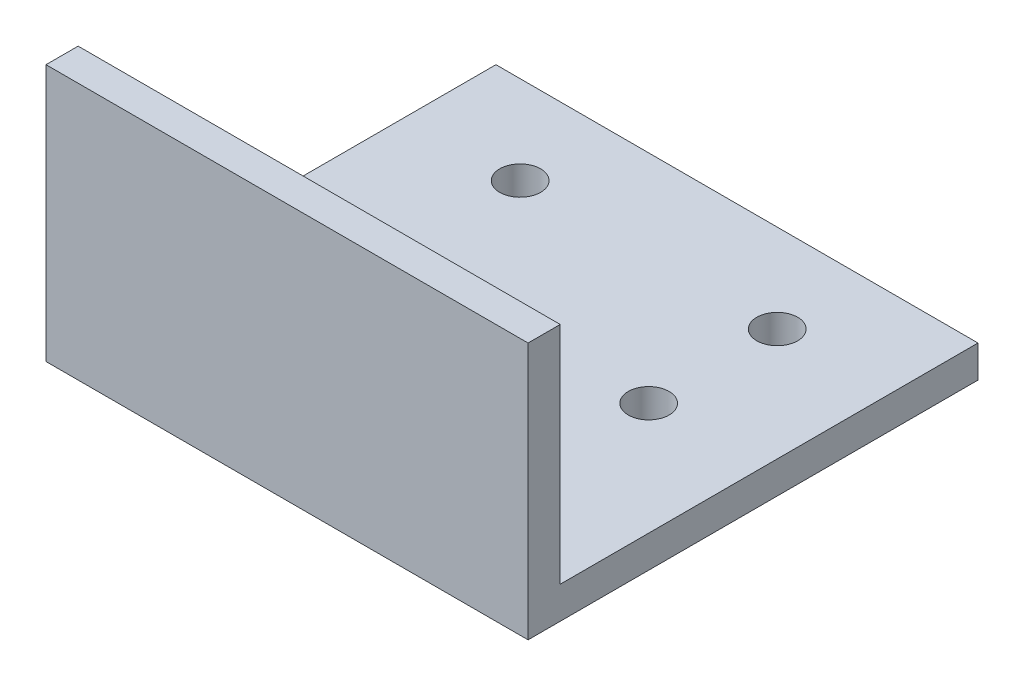
ISO-10303-21;
HEADER;
FILE_DESCRIPTION(('STEP AP214'),'2;1');
FILE_NAME('part.step','',(''),(''),'','','');
FILE_SCHEMA(('AUTOMOTIVE_DESIGN { 1 0 10303 214 1 1 1 1 }'));
ENDSEC;
DATA;
#1=APPLICATION_CONTEXT('core data for automotive mechanical design processes');
#2=APPLICATION_PROTOCOL_DEFINITION('international standard','automotive_design',2000,#1);
#3=PRODUCT_CONTEXT('',#1,'mechanical');
#4=PRODUCT('Part','Part','',(#3));
#5=PRODUCT_RELATED_PRODUCT_CATEGORY('part','',(#4));
#6=PRODUCT_DEFINITION_FORMATION('','',#4);
#7=PRODUCT_DEFINITION_CONTEXT('part definition',#1,'design');
#8=PRODUCT_DEFINITION('design','',#6,#7);
#9=PRODUCT_DEFINITION_SHAPE('','',#8);
#10=(LENGTH_UNIT() NAMED_UNIT(*) SI_UNIT(.MILLI.,.METRE.));
#11=(NAMED_UNIT(*) PLANE_ANGLE_UNIT() SI_UNIT($,.RADIAN.));
#12=(NAMED_UNIT(*) SI_UNIT($,.STERADIAN.) SOLID_ANGLE_UNIT());
#13=UNCERTAINTY_MEASURE_WITH_UNIT(LENGTH_MEASURE(1.E-05),#10,'distance_accuracy_value','');
#14=(GEOMETRIC_REPRESENTATION_CONTEXT(3) GLOBAL_UNCERTAINTY_ASSIGNED_CONTEXT((#13)) GLOBAL_UNIT_ASSIGNED_CONTEXT((#10,
#11,#12)) REPRESENTATION_CONTEXT('',''));
#15=CARTESIAN_POINT('',(0.,0.,0.));
#16=DIRECTION('',(0.,0.,1.));
#17=DIRECTION('',(1.,0.,0.));
#18=AXIS2_PLACEMENT_3D('',#15,#16,#17);
#19=CARTESIAN_POINT('',(47.625,0.,0.));
#20=DIRECTION('',(0.,0.,-1.));
#21=DIRECTION('',(-1.,0.,0.));
#22=AXIS2_PLACEMENT_3D('',#19,#20,#21);
#23=PLANE('',#22);
#24=DIRECTION('',(0.,-1.,0.));
#25=VECTOR('',#24,1.);
#26=CARTESIAN_POINT('',(0.,0.,0.));
#27=LINE('',#26,#25);
#28=CARTESIAN_POINT('',(0.,25.4,0.));
#29=VERTEX_POINT('',#28);
#30=CARTESIAN_POINT('',(0.,0.,0.));
#31=VERTEX_POINT('',#30);
#32=EDGE_CURVE('E122',#29,#31,#27,.T.);
#33=ORIENTED_EDGE('',*,*,#32,.T.);
#34=DIRECTION('',(-1.,0.,0.));
#35=VECTOR('',#34,1.);
#36=CARTESIAN_POINT('',(47.625,0.,0.));
#37=LINE('',#36,#35);
#38=CARTESIAN_POINT('',(47.625,0.,0.));
#39=VERTEX_POINT('',#38);
#40=EDGE_CURVE('E11',#39,#31,#37,.T.);
#41=ORIENTED_EDGE('',*,*,#40,.F.);
#42=DIRECTION('',(0.,-1.,0.));
#43=VECTOR('',#42,1.);
#44=CARTESIAN_POINT('',(47.625,0.,0.));
#45=LINE('',#44,#43);
#46=CARTESIAN_POINT('',(47.625,25.4,0.));
#47=VERTEX_POINT('',#46);
#48=EDGE_CURVE('E135',#47,#39,#45,.T.);
#49=ORIENTED_EDGE('',*,*,#48,.F.);
#50=DIRECTION('',(-1.,0.,0.));
#51=VECTOR('',#50,1.);
#52=CARTESIAN_POINT('',(47.625,25.4,0.));
#53=LINE('',#52,#51);
#54=EDGE_CURVE('E118',#47,#29,#53,.T.);
#55=ORIENTED_EDGE('',*,*,#54,.T.);
#56=EDGE_LOOP('',(#33,#41,#49,#55));
#57=FACE_BOUND('',#56,.T.);
#58=ADVANCED_FACE('F37',(#57),#23,.F.);
#59=CARTESIAN_POINT('',(47.625,0.,0.));
#60=DIRECTION('',(0.,1.,0.));
#61=DIRECTION('',(0.,0.,1.));
#62=AXIS2_PLACEMENT_3D('',#59,#60,#61);
#63=PLANE('',#62);
#64=CARTESIAN_POINT('',(11.1125,0.,-35.729000000002));
#65=DIRECTION('',(0.,1.,0.));
#66=DIRECTION('',(0.,0.,1.));
#67=AXIS2_PLACEMENT_3D('',#64,#65,#66);
#68=CIRCLE('',#67,2.01929999999999);
#69=CARTESIAN_POINT('',(11.1125,0.,-33.709700000002));
#70=VERTEX_POINT('',#69);
#71=EDGE_CURVE('E193',#70,#70,#68,.F.);
#72=ORIENTED_EDGE('',*,*,#71,.F.);
#73=EDGE_LOOP('',(#72));
#74=FACE_BOUND('',#73,.T.);
#75=CARTESIAN_POINT('',(36.5125,0.,-23.029000000002));
#76=DIRECTION('',(0.,1.,0.));
#77=DIRECTION('',(0.,0.,1.));
#78=AXIS2_PLACEMENT_3D('',#75,#76,#77);
#79=CIRCLE('',#78,2.01929999999999);
#80=CARTESIAN_POINT('',(36.5125,0.,-21.009700000002));
#81=VERTEX_POINT('',#80);
#82=EDGE_CURVE('E201',#81,#81,#79,.F.);
#83=ORIENTED_EDGE('',*,*,#82,.F.);
#84=EDGE_LOOP('',(#83));
#85=FACE_BOUND('',#84,.T.);
#86=CARTESIAN_POINT('',(36.5125,0.,-35.729000000002));
#87=DIRECTION('',(0.,1.,0.));
#88=DIRECTION('',(0.,0.,1.));
#89=AXIS2_PLACEMENT_3D('',#86,#87,#88);
#90=CIRCLE('',#89,2.01929999999999);
#91=CARTESIAN_POINT('',(36.5125,0.,-33.709700000002));
#92=VERTEX_POINT('',#91);
#93=EDGE_CURVE('E207',#92,#92,#90,.F.);
#94=ORIENTED_EDGE('',*,*,#93,.F.);
#95=EDGE_LOOP('',(#94));
#96=FACE_BOUND('',#95,.T.);
#97=CARTESIAN_POINT('',(11.1125,0.,-23.029000000002));
#98=DIRECTION('',(0.,1.,0.));
#99=DIRECTION('',(0.,0.,1.));
#100=AXIS2_PLACEMENT_3D('',#97,#98,#99);
#101=CIRCLE('',#100,2.01929999999999);
#102=CARTESIAN_POINT('',(11.1125,0.,-21.009700000002));
#103=VERTEX_POINT('',#102);
#104=EDGE_CURVE('E126',#103,#103,#101,.F.);
#105=ORIENTED_EDGE('',*,*,#104,.F.);
#106=EDGE_LOOP('',(#105));
#107=FACE_BOUND('',#106,.T.);
#108=DIRECTION('',(0.,0.,-1.));
#109=VECTOR('',#108,1.);
#110=CARTESIAN_POINT('',(0.,0.,0.));
#111=LINE('',#110,#109);
#112=CARTESIAN_POINT('',(0.,0.,-44.45));
#113=VERTEX_POINT('',#112);
#114=EDGE_CURVE('E125',#31,#113,#111,.T.);
#115=ORIENTED_EDGE('',*,*,#114,.T.);
#116=DIRECTION('',(-1.,0.,0.));
#117=VECTOR('',#116,1.);
#118=CARTESIAN_POINT('',(47.625,0.,-44.45));
#119=LINE('',#118,#117);
#120=CARTESIAN_POINT('',(47.625,0.,-44.45));
#121=VERTEX_POINT('',#120);
#122=EDGE_CURVE('E45',#121,#113,#119,.T.);
#123=ORIENTED_EDGE('',*,*,#122,.F.);
#124=DIRECTION('',(0.,0.,-1.));
#125=VECTOR('',#124,1.);
#126=CARTESIAN_POINT('',(47.625,0.,0.));
#127=LINE('',#126,#125);
#128=EDGE_CURVE('E90',#39,#121,#127,.T.);
#129=ORIENTED_EDGE('',*,*,#128,.F.);
#130=ORIENTED_EDGE('',*,*,#40,.T.);
#131=EDGE_LOOP('',(#115,#123,#129,#130));
#132=FACE_BOUND('',#131,.T.);
#133=ADVANCED_FACE('F161',(#74,#85,#96,#107,#132),#63,.F.);
#134=CARTESIAN_POINT('',(47.625,0.,-44.45));
#135=DIRECTION('',(0.,0.,1.));
#136=DIRECTION('',(1.,0.,0.));
#137=AXIS2_PLACEMENT_3D('',#134,#135,#136);
#138=PLANE('',#137);
#139=DIRECTION('',(0.,1.,0.));
#140=VECTOR('',#139,1.);
#141=CARTESIAN_POINT('',(0.,0.,-44.45));
#142=LINE('',#141,#140);
#143=CARTESIAN_POINT('',(0.,3.175,-44.45));
#144=VERTEX_POINT('',#143);
#145=EDGE_CURVE('E129',#113,#144,#142,.T.);
#146=ORIENTED_EDGE('',*,*,#145,.T.);
#147=DIRECTION('',(-1.,0.,0.));
#148=VECTOR('',#147,1.);
#149=CARTESIAN_POINT('',(47.625,3.175,-44.45));
#150=LINE('',#149,#148);
#151=CARTESIAN_POINT('',(47.625,3.175,-44.45));
#152=VERTEX_POINT('',#151);
#153=EDGE_CURVE('E113',#152,#144,#150,.T.);
#154=ORIENTED_EDGE('',*,*,#153,.F.);
#155=DIRECTION('',(0.,1.,0.));
#156=VECTOR('',#155,1.);
#157=CARTESIAN_POINT('',(47.625,0.,-44.45));
#158=LINE('',#157,#156);
#159=EDGE_CURVE('E103',#121,#152,#158,.T.);
#160=ORIENTED_EDGE('',*,*,#159,.F.);
#161=ORIENTED_EDGE('',*,*,#122,.T.);
#162=EDGE_LOOP('',(#146,#154,#160,#161));
#163=FACE_BOUND('',#162,.T.);
#164=ADVANCED_FACE('F143',(#163),#138,.F.);
#165=CARTESIAN_POINT('',(47.625,3.175,-3.175));
#166=DIRECTION('',(0.,-1.,0.));
#167=DIRECTION('',(0.,0.,-1.));
#168=AXIS2_PLACEMENT_3D('',#165,#166,#167);
#169=PLANE('',#168);
#170=CARTESIAN_POINT('',(11.1125,3.175,-35.729000000002));
#171=DIRECTION('',(0.,1.,0.));
#172=DIRECTION('',(0.,0.,1.));
#173=AXIS2_PLACEMENT_3D('',#170,#171,#172);
#174=CIRCLE('',#173,2.01929999999999);
#175=CARTESIAN_POINT('',(11.1125,3.175,-33.709700000002));
#176=VERTEX_POINT('',#175);
#177=EDGE_CURVE('E179',#176,#176,#174,.T.);
#178=ORIENTED_EDGE('',*,*,#177,.F.);
#179=EDGE_LOOP('',(#178));
#180=FACE_BOUND('',#179,.T.);
#181=CARTESIAN_POINT('',(36.5125,3.175,-23.029000000002));
#182=DIRECTION('',(0.,1.,0.));
#183=DIRECTION('',(0.,0.,1.));
#184=AXIS2_PLACEMENT_3D('',#181,#182,#183);
#185=CIRCLE('',#184,2.01929999999999);
#186=CARTESIAN_POINT('',(36.5125,3.175,-21.009700000002));
#187=VERTEX_POINT('',#186);
#188=EDGE_CURVE('E183',#187,#187,#185,.T.);
#189=ORIENTED_EDGE('',*,*,#188,.F.);
#190=EDGE_LOOP('',(#189));
#191=FACE_BOUND('',#190,.T.);
#192=CARTESIAN_POINT('',(36.5125,3.175,-35.729000000002));
#193=DIRECTION('',(0.,1.,0.));
#194=DIRECTION('',(0.,0.,1.));
#195=AXIS2_PLACEMENT_3D('',#192,#193,#194);
#196=CIRCLE('',#195,2.01929999999999);
#197=CARTESIAN_POINT('',(36.5125,3.175,-33.709700000002));
#198=VERTEX_POINT('',#197);
#199=EDGE_CURVE('E187',#198,#198,#196,.T.);
#200=ORIENTED_EDGE('',*,*,#199,.F.);
#201=EDGE_LOOP('',(#200));
#202=FACE_BOUND('',#201,.T.);
#203=CARTESIAN_POINT('',(11.1125,3.175,-23.029000000002));
#204=DIRECTION('',(0.,1.,0.));
#205=DIRECTION('',(0.,0.,1.));
#206=AXIS2_PLACEMENT_3D('',#203,#204,#205);
#207=CIRCLE('',#206,2.01929999999999);
#208=CARTESIAN_POINT('',(11.1125,3.175,-21.009700000002));
#209=VERTEX_POINT('',#208);
#210=EDGE_CURVE('E190',#209,#209,#207,.T.);
#211=ORIENTED_EDGE('',*,*,#210,.F.);
#212=EDGE_LOOP('',(#211));
#213=FACE_BOUND('',#212,.T.);
#214=DIRECTION('',(0.,0.,1.));
#215=VECTOR('',#214,1.);
#216=CARTESIAN_POINT('',(0.,3.175,-3.175));
#217=LINE('',#216,#215);
#218=CARTESIAN_POINT('',(0.,3.175,-3.175));
#219=VERTEX_POINT('',#218);
#220=EDGE_CURVE('E112',#144,#219,#217,.T.);
#221=ORIENTED_EDGE('',*,*,#220,.T.);
#222=DIRECTION('',(-1.,0.,0.));
#223=VECTOR('',#222,1.);
#224=CARTESIAN_POINT('',(47.625,3.175,-3.175));
#225=LINE('',#224,#223);
#226=CARTESIAN_POINT('',(47.625,3.175,-3.175));
#227=VERTEX_POINT('',#226);
#228=EDGE_CURVE('E109',#227,#219,#225,.T.);
#229=ORIENTED_EDGE('',*,*,#228,.F.);
#230=DIRECTION('',(0.,0.,1.));
#231=VECTOR('',#230,1.);
#232=CARTESIAN_POINT('',(47.625,3.175,-3.175));
#233=LINE('',#232,#231);
#234=EDGE_CURVE('E97',#152,#227,#233,.T.);
#235=ORIENTED_EDGE('',*,*,#234,.F.);
#236=ORIENTED_EDGE('',*,*,#153,.T.);
#237=EDGE_LOOP('',(#221,#229,#235,#236));
#238=FACE_BOUND('',#237,.T.);
#239=ADVANCED_FACE('F110',(#180,#191,#202,#213,#238),#169,.F.);
#240=CARTESIAN_POINT('',(47.625,3.175,-3.175));
#241=DIRECTION('',(0.,0.,1.));
#242=DIRECTION('',(1.,0.,0.));
#243=AXIS2_PLACEMENT_3D('',#240,#241,#242);
#244=PLANE('',#243);
#245=DIRECTION('',(0.,1.,0.));
#246=VECTOR('',#245,1.);
#247=CARTESIAN_POINT('',(0.,3.175,-3.175));
#248=LINE('',#247,#246);
#249=CARTESIAN_POINT('',(0.,25.4,-3.175));
#250=VERTEX_POINT('',#249);
#251=EDGE_CURVE('E76',#219,#250,#248,.T.);
#252=ORIENTED_EDGE('',*,*,#251,.T.);
#253=DIRECTION('',(-1.,0.,0.));
#254=VECTOR('',#253,1.);
#255=CARTESIAN_POINT('',(47.625,25.4,-3.175));
#256=LINE('',#255,#254);
#257=CARTESIAN_POINT('',(47.625,25.4,-3.175));
#258=VERTEX_POINT('',#257);
#259=EDGE_CURVE('E114',#258,#250,#256,.T.);
#260=ORIENTED_EDGE('',*,*,#259,.F.);
#261=DIRECTION('',(0.,1.,0.));
#262=VECTOR('',#261,1.);
#263=CARTESIAN_POINT('',(47.625,3.175,-3.175));
#264=LINE('',#263,#262);
#265=EDGE_CURVE('E101',#227,#258,#264,.T.);
#266=ORIENTED_EDGE('',*,*,#265,.F.);
#267=ORIENTED_EDGE('',*,*,#228,.T.);
#268=EDGE_LOOP('',(#252,#260,#266,#267));
#269=FACE_BOUND('',#268,.T.);
#270=ADVANCED_FACE('F116',(#269),#244,.F.);
#271=CARTESIAN_POINT('',(47.625,25.4,0.));
#272=DIRECTION('',(0.,-1.,0.));
#273=DIRECTION('',(0.,0.,-1.));
#274=AXIS2_PLACEMENT_3D('',#271,#272,#273);
#275=PLANE('',#274);
#276=DIRECTION('',(0.,0.,1.));
#277=VECTOR('',#276,1.);
#278=CARTESIAN_POINT('',(0.,25.4,0.));
#279=LINE('',#278,#277);
#280=EDGE_CURVE('E82',#250,#29,#279,.T.);
#281=ORIENTED_EDGE('',*,*,#280,.T.);
#282=ORIENTED_EDGE('',*,*,#54,.F.);
#283=DIRECTION('',(0.,0.,1.));
#284=VECTOR('',#283,1.);
#285=CARTESIAN_POINT('',(47.625,25.4,0.));
#286=LINE('',#285,#284);
#287=EDGE_CURVE('E53',#258,#47,#286,.T.);
#288=ORIENTED_EDGE('',*,*,#287,.F.);
#289=ORIENTED_EDGE('',*,*,#259,.T.);
#290=EDGE_LOOP('',(#281,#282,#288,#289));
#291=FACE_BOUND('',#290,.T.);
#292=ADVANCED_FACE('F150',(#291),#275,.F.);
#293=CARTESIAN_POINT('',(47.625,0.,0.));
#294=DIRECTION('',(-1.,0.,0.));
#295=DIRECTION('',(0.,0.,1.));
#296=AXIS2_PLACEMENT_3D('',#293,#294,#295);
#297=PLANE('',#296);
#298=ORIENTED_EDGE('',*,*,#48,.T.);
#299=ORIENTED_EDGE('',*,*,#128,.T.);
#300=ORIENTED_EDGE('',*,*,#159,.T.);
#301=ORIENTED_EDGE('',*,*,#234,.T.);
#302=ORIENTED_EDGE('',*,*,#265,.T.);
#303=ORIENTED_EDGE('',*,*,#287,.T.);
#304=EDGE_LOOP('',(#298,#299,#300,#301,#302,#303));
#305=FACE_BOUND('',#304,.T.);
#306=ADVANCED_FACE('F99',(#305),#297,.F.);
#307=CARTESIAN_POINT('',(0.,0.,0.));
#308=DIRECTION('',(-1.,0.,0.));
#309=DIRECTION('',(0.,0.,1.));
#310=AXIS2_PLACEMENT_3D('',#307,#308,#309);
#311=PLANE('',#310);
#312=ORIENTED_EDGE('',*,*,#32,.F.);
#313=ORIENTED_EDGE('',*,*,#280,.F.);
#314=ORIENTED_EDGE('',*,*,#251,.F.);
#315=ORIENTED_EDGE('',*,*,#220,.F.);
#316=ORIENTED_EDGE('',*,*,#145,.F.);
#317=ORIENTED_EDGE('',*,*,#114,.F.);
#318=EDGE_LOOP('',(#312,#313,#314,#315,#316,#317));
#319=FACE_BOUND('',#318,.T.);
#320=ADVANCED_FACE('F146',(#319),#311,.T.);
#321=CARTESIAN_POINT('',(11.1125,-0.00100000000000013,-23.029000000002));
#322=DIRECTION('',(0.,1.,0.));
#323=DIRECTION('',(0.,0.,1.));
#324=AXIS2_PLACEMENT_3D('',#321,#322,#323);
#325=CYLINDRICAL_SURFACE('',#324,2.01929999999999);
#326=ORIENTED_EDGE('',*,*,#210,.T.);
#327=EDGE_LOOP('',(#326));
#328=FACE_BOUND('',#327,.T.);
#329=ORIENTED_EDGE('',*,*,#104,.T.);
#330=EDGE_LOOP('',(#329));
#331=FACE_BOUND('',#330,.T.);
#332=ADVANCED_FACE('F217',(#328,#331),#325,.F.);
#333=CARTESIAN_POINT('',(36.5125,-0.00100000000000013,-35.729000000002));
#334=DIRECTION('',(0.,1.,0.));
#335=DIRECTION('',(0.,0.,1.));
#336=AXIS2_PLACEMENT_3D('',#333,#334,#335);
#337=CYLINDRICAL_SURFACE('',#336,2.01929999999999);
#338=ORIENTED_EDGE('',*,*,#199,.T.);
#339=EDGE_LOOP('',(#338));
#340=FACE_BOUND('',#339,.T.);
#341=ORIENTED_EDGE('',*,*,#93,.T.);
#342=EDGE_LOOP('',(#341));
#343=FACE_BOUND('',#342,.T.);
#344=ADVANCED_FACE('F213',(#340,#343),#337,.F.);
#345=CARTESIAN_POINT('',(36.5125,-0.00100000000000013,-23.029000000002));
#346=DIRECTION('',(0.,1.,0.));
#347=DIRECTION('',(0.,0.,1.));
#348=AXIS2_PLACEMENT_3D('',#345,#346,#347);
#349=CYLINDRICAL_SURFACE('',#348,2.01929999999999);
#350=ORIENTED_EDGE('',*,*,#188,.T.);
#351=EDGE_LOOP('',(#350));
#352=FACE_BOUND('',#351,.T.);
#353=ORIENTED_EDGE('',*,*,#82,.T.);
#354=EDGE_LOOP('',(#353));
#355=FACE_BOUND('',#354,.T.);
#356=ADVANCED_FACE('F216',(#352,#355),#349,.F.);
#357=CARTESIAN_POINT('',(11.1125,-0.00100000000000013,-35.729000000002));
#358=DIRECTION('',(0.,1.,0.));
#359=DIRECTION('',(0.,0.,1.));
#360=AXIS2_PLACEMENT_3D('',#357,#358,#359);
#361=CYLINDRICAL_SURFACE('',#360,2.01929999999999);
#362=ORIENTED_EDGE('',*,*,#177,.T.);
#363=EDGE_LOOP('',(#362));
#364=FACE_BOUND('',#363,.T.);
#365=ORIENTED_EDGE('',*,*,#71,.T.);
#366=EDGE_LOOP('',(#365));
#367=FACE_BOUND('',#366,.T.);
#368=ADVANCED_FACE('F232',(#364,#367),#361,.F.);
#369=CLOSED_SHELL('',(#58,#133,#164,#239,#270,#292,#306,#320,#332,#344,#356,#368));
#370=MANIFOLD_SOLID_BREP('B2',#369);
#371=ADVANCED_BREP_SHAPE_REPRESENTATION('',(#18,#370),#14);
#372=SHAPE_DEFINITION_REPRESENTATION(#9,#371);
ENDSEC;
END-ISO-10303-21;
